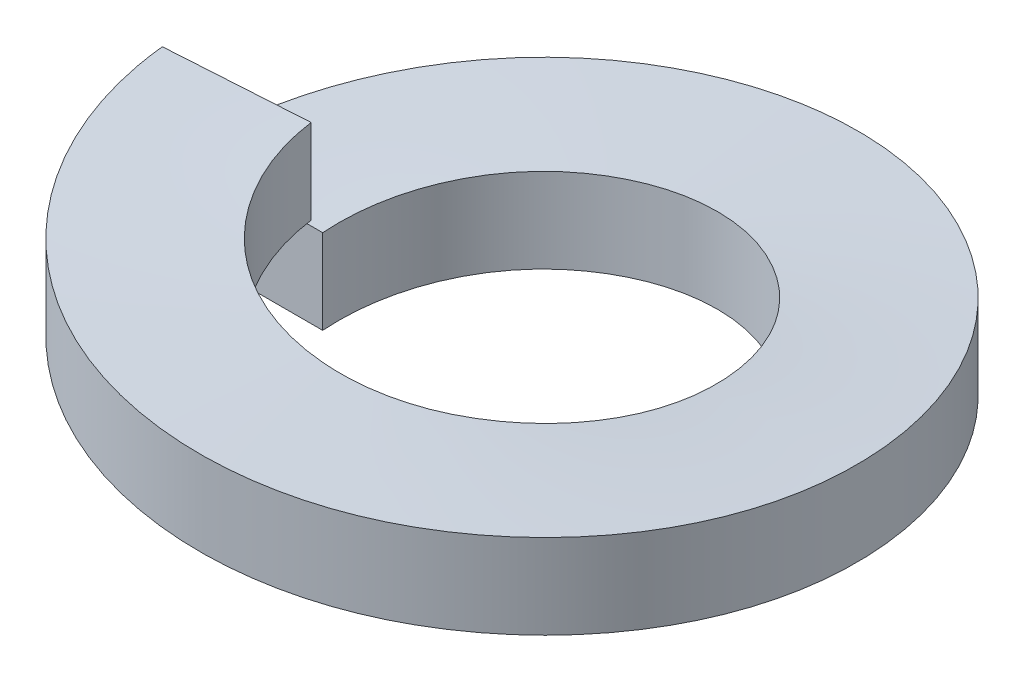
ISO-10303-21;
HEADER;
FILE_DESCRIPTION(('STEP AP214'),'2;1');
FILE_NAME('part.step','',(''),(''),'','','');
FILE_SCHEMA(('AUTOMOTIVE_DESIGN { 1 0 10303 214 1 1 1 1 }'));
ENDSEC;
DATA;
#1=APPLICATION_CONTEXT('core data for automotive mechanical design processes');
#2=APPLICATION_PROTOCOL_DEFINITION('international standard','automotive_design',2000,#1);
#3=PRODUCT_CONTEXT('',#1,'mechanical');
#4=PRODUCT('Part','Part','',(#3));
#5=PRODUCT_RELATED_PRODUCT_CATEGORY('part','',(#4));
#6=PRODUCT_DEFINITION_FORMATION('','',#4);
#7=PRODUCT_DEFINITION_CONTEXT('part definition',#1,'design');
#8=PRODUCT_DEFINITION('design','',#6,#7);
#9=PRODUCT_DEFINITION_SHAPE('','',#8);
#10=(LENGTH_UNIT() NAMED_UNIT(*) SI_UNIT(.MILLI.,.METRE.));
#11=(NAMED_UNIT(*) PLANE_ANGLE_UNIT() SI_UNIT($,.RADIAN.));
#12=(NAMED_UNIT(*) SI_UNIT($,.STERADIAN.) SOLID_ANGLE_UNIT());
#13=UNCERTAINTY_MEASURE_WITH_UNIT(LENGTH_MEASURE(1.E-05),#10,'distance_accuracy_value','');
#14=(GEOMETRIC_REPRESENTATION_CONTEXT(3) GLOBAL_UNCERTAINTY_ASSIGNED_CONTEXT((#13)) GLOBAL_UNIT_ASSIGNED_CONTEXT((#10,
#11,#12)) REPRESENTATION_CONTEXT('',''));
#15=CARTESIAN_POINT('',(0.,0.,0.));
#16=DIRECTION('',(0.,0.,1.));
#17=DIRECTION('',(1.,0.,0.));
#18=AXIS2_PLACEMENT_3D('',#15,#16,#17);
#19=CARTESIAN_POINT('',(0.,0.,0.));
#20=DIRECTION('',(0.,1.,0.));
#21=DIRECTION('',(1.,0.,0.));
#22=AXIS2_PLACEMENT_3D('',#19,#20,#21);
#23=CYLINDRICAL_SURFACE('',#22,4.25);
#24=CARTESIAN_POINT('',(-4.25,0.,0.));
#25=CARTESIAN_POINT('',(-4.25,0.19,-2.42415720111151));
#26=CARTESIAN_POINT('',(-2.16342601693907,0.38,-3.65815361476677));
#27=CARTESIAN_POINT('',(-1.1626684330995,0.471127341984099,-4.25));
#28=CARTESIAN_POINT('',(0.,0.576023489908225,-4.25));
#29=(BOUNDED_CURVE() B_SPLINE_CURVE(2,(#24,#25,#26,#27,#28),.UNSPECIFIED.,.F.,
.F.) B_SPLINE_CURVE_WITH_KNOTS((3,2,3),(0.,0.166666666666667,0.252468503816904),
.UNSPECIFIED.) CURVE() GEOMETRIC_REPRESENTATION_ITEM() RATIONAL_B_SPLINE_CURVE((1.,
0.868631514438191,1.,0.932370055570913,0.934373392882436)) REPRESENTATION_ITEM(''));
#30=CARTESIAN_POINT('',(-4.25,0.,0.));
#31=VERTEX_POINT('',#30);
#32=CARTESIAN_POINT('',(0.,0.576023489908225,-4.25));
#33=VERTEX_POINT('',#32);
#34=EDGE_CURVE('E10',#31,#33,#29,.T.);
#35=ORIENTED_EDGE('',*,*,#34,.T.);
#36=CARTESIAN_POINT('',(0.,0.576023489908225,-4.25));
#37=CARTESIAN_POINT('',(1.09121453156285,0.674473054428204,-4.25));
#38=CARTESIAN_POINT('',(2.04745311493231,0.76,-3.72430339018641));
#39=CARTESIAN_POINT('',(4.17175826374275,0.95,-2.5564567519508));
#40=CARTESIAN_POINT('',(4.24790288155436,1.14,-0.133495726082015));
#41=CARTESIAN_POINT('',(4.32404749936597,1.33,2.28946529978677));
#42=CARTESIAN_POINT('',(2.2772638786607,1.52,3.58839368338359));
#43=CARTESIAN_POINT('',(1.23473914111062,1.61677608230335,4.25));
#44=CARTESIAN_POINT('',(0.,1.72806452526736,4.25));
#45=(BOUNDED_CURVE() B_SPLINE_CURVE(2,(#36,#37,#38,#39,#40,#41,#42,#43,#44),.UNSPECIFIED.,.F.,
.F.) B_SPLINE_CURVE_WITH_KNOTS((3,2,2,2,3),(0.252468503816904,0.333333333333333,0.5,
0.666666666666667,0.757406729884102),
.UNSPECIFIED.) CURVE() GEOMETRIC_REPRESENTATION_ITEM() RATIONAL_B_SPLINE_CURVE((0.934373392882436,
0.936261458867277,1.,0.868631514438191,1.,0.868631514438191,1.,0.928477691892056,0.934834648894173)) REPRESENTATION_ITEM(''));
#46=CARTESIAN_POINT('',(0.,1.72806452526736,4.25));
#47=VERTEX_POINT('',#46);
#48=EDGE_CURVE('E26',#33,#47,#45,.T.);
#49=ORIENTED_EDGE('',*,*,#48,.T.);
#50=CARTESIAN_POINT('',(0.,1.72806452526736,4.25));
#51=CARTESIAN_POINT('',(-1.02033472609052,1.82002845447964,4.25));
#52=CARTESIAN_POINT('',(-1.92945962389312,1.9,3.78677772780054));
#53=CARTESIAN_POINT('',(-4.08939950574167,2.09,2.68623338862068));
#54=CARTESIAN_POINT('',(-4.24161359582016,2.28,0.266859707999521));
#55=(BOUNDED_CURVE() B_SPLINE_CURVE(2,(#50,#51,#52,#53,#54),.UNSPECIFIED.,.F.,
.F.) B_SPLINE_CURVE_WITH_KNOTS((3,2,3),(0.757406729884102,0.833333333333333,1.),
.UNSPECIFIED.) CURVE() GEOMETRIC_REPRESENTATION_ITEM() RATIONAL_B_SPLINE_CURVE((0.934834648894173,
0.940153822546135,1.,0.868631514438191,1.)) REPRESENTATION_ITEM(''));
#56=CARTESIAN_POINT('',(-4.24161359582016,2.28,0.266859707999521));
#57=VERTEX_POINT('',#56);
#58=EDGE_CURVE('E175',#47,#57,#55,.T.);
#59=ORIENTED_EDGE('',*,*,#58,.T.);
#60=DIRECTION('',(0.,1.,0.));
#61=VECTOR('',#60,1.);
#62=CARTESIAN_POINT('',(-4.24161359582016,2.28,0.266859707999521));
#63=LINE('',#62,#61);
#64=CARTESIAN_POINT('',(-4.24161359582016,4.18,0.266859707999521));
#65=VERTEX_POINT('',#64);
#66=EDGE_CURVE('E97',#57,#65,#63,.T.);
#67=ORIENTED_EDGE('',*,*,#66,.T.);
#68=CARTESIAN_POINT('',(0.,3.62806452526736,4.25));
#69=CARTESIAN_POINT('',(-1.02033472609052,3.72002845447964,4.25));
#70=CARTESIAN_POINT('',(-1.92945962389312,3.8,3.78677772780054));
#71=CARTESIAN_POINT('',(-4.08939950574167,3.99,2.68623338862068));
#72=CARTESIAN_POINT('',(-4.24161359582016,4.18,0.266859707999521));
#73=(BOUNDED_CURVE() B_SPLINE_CURVE(2,(#68,#69,#70,#71,#72),.UNSPECIFIED.,.F.,
.F.) B_SPLINE_CURVE_WITH_KNOTS((3,2,3),(0.757406729884102,0.833333333333333,1.),
.UNSPECIFIED.) CURVE() GEOMETRIC_REPRESENTATION_ITEM() RATIONAL_B_SPLINE_CURVE((0.934834648894173,
0.940153822546135,1.,0.868631514438191,1.)) REPRESENTATION_ITEM(''));
#74=CARTESIAN_POINT('',(0.,3.62806452526736,4.25));
#75=VERTEX_POINT('',#74);
#76=EDGE_CURVE('E164',#75,#65,#73,.T.);
#77=ORIENTED_EDGE('',*,*,#76,.F.);
#78=CARTESIAN_POINT('',(0.,2.47602348990823,-4.25));
#79=CARTESIAN_POINT('',(1.09121453156285,2.5744730544282,-4.25));
#80=CARTESIAN_POINT('',(2.04745311493231,2.66,-3.72430339018641));
#81=CARTESIAN_POINT('',(4.17175826374275,2.85,-2.5564567519508));
#82=CARTESIAN_POINT('',(4.24790288155436,3.04,-0.133495726082015));
#83=CARTESIAN_POINT('',(4.32404749936597,3.23,2.28946529978677));
#84=CARTESIAN_POINT('',(2.2772638786607,3.42,3.58839368338359));
#85=CARTESIAN_POINT('',(1.23473914111062,3.51677608230335,4.25));
#86=CARTESIAN_POINT('',(0.,3.62806452526736,4.25));
#87=(BOUNDED_CURVE() B_SPLINE_CURVE(2,(#78,#79,#80,#81,#82,#83,#84,#85,#86),.UNSPECIFIED.,.F.,
.F.) B_SPLINE_CURVE_WITH_KNOTS((3,2,2,2,3),(0.252468503816904,0.333333333333333,0.5,
0.666666666666667,0.757406729884102),
.UNSPECIFIED.) CURVE() GEOMETRIC_REPRESENTATION_ITEM() RATIONAL_B_SPLINE_CURVE((0.934373392882436,
0.936261458867277,1.,0.868631514438191,1.,0.868631514438191,1.,0.928477691892056,0.934834648894173)) REPRESENTATION_ITEM(''));
#88=CARTESIAN_POINT('',(0.,2.47602348990823,-4.25));
#89=VERTEX_POINT('',#88);
#90=EDGE_CURVE('E103',#89,#75,#87,.T.);
#91=ORIENTED_EDGE('',*,*,#90,.F.);
#92=CARTESIAN_POINT('',(-4.25,1.9,0.));
#93=CARTESIAN_POINT('',(-4.25,2.09,-2.42415720111151));
#94=CARTESIAN_POINT('',(-2.16342601693907,2.28,-3.65815361476677));
#95=CARTESIAN_POINT('',(-1.1626684330995,2.3711273419841,-4.25));
#96=CARTESIAN_POINT('',(0.,2.47602348990823,-4.25));
#97=(BOUNDED_CURVE() B_SPLINE_CURVE(2,(#92,#93,#94,#95,#96),.UNSPECIFIED.,.F.,
.F.) B_SPLINE_CURVE_WITH_KNOTS((3,2,3),(0.,0.166666666666667,0.252468503816904),
.UNSPECIFIED.) CURVE() GEOMETRIC_REPRESENTATION_ITEM() RATIONAL_B_SPLINE_CURVE((1.,
0.868631514438191,1.,0.932370055570913,0.934373392882436)) REPRESENTATION_ITEM(''));
#98=CARTESIAN_POINT('',(-4.25,1.9,0.));
#99=VERTEX_POINT('',#98);
#100=EDGE_CURVE('E100',#99,#89,#97,.T.);
#101=ORIENTED_EDGE('',*,*,#100,.F.);
#102=DIRECTION('',(0.,1.,0.));
#103=VECTOR('',#102,1.);
#104=CARTESIAN_POINT('',(-4.25,0.,0.));
#105=LINE('',#104,#103);
#106=EDGE_CURVE('E109',#31,#99,#105,.T.);
#107=ORIENTED_EDGE('',*,*,#106,.F.);
#108=EDGE_LOOP('',(#35,#49,#59,#67,#77,#91,#101,#107));
#109=FACE_BOUND('',#108,.T.);
#110=ADVANCED_FACE('F16',(#109),#23,.F.);
#111=CARTESIAN_POINT('',(0.,0.,0.));
#112=DIRECTION('',(0.,1.,0.));
#113=DIRECTION('',(1.,0.,0.));
#114=AXIS2_PLACEMENT_3D('',#111,#112,#113);
#115=CYLINDRICAL_SURFACE('',#114,7.4);
#116=CARTESIAN_POINT('',(0.,0.576023489908225,-7.4));
#117=CARTESIAN_POINT('',(1.8999970667212,0.674473054428204,-7.4));
#118=CARTESIAN_POINT('',(3.56497718835272,0.76,-6.48466943232457));
#119=CARTESIAN_POINT('',(7.26376732981091,0.95,-4.45124234457316));
#120=CARTESIAN_POINT('',(7.39634854670642,1.14,-0.232439617178096));
#121=CARTESIAN_POINT('',(7.52892976360192,1.33,3.98636311021696));
#122=CARTESIAN_POINT('',(3.96511828284452,1.52,6.24802664871495));
#123=CARTESIAN_POINT('',(2.14989873981614,1.61677608230335,7.4));
#124=CARTESIAN_POINT('',(0.,1.72806452526736,7.4));
#125=(BOUNDED_CURVE() B_SPLINE_CURVE(2,(#116,#117,#118,#119,#120,#121,#122,#123,#124),
.UNSPECIFIED.,.F.,.F.) B_SPLINE_CURVE_WITH_KNOTS((3,2,2,2,3),(0.252468503816904,
0.333333333333333,0.5,0.666666666666667,0.757406729884102),
.UNSPECIFIED.) CURVE() GEOMETRIC_REPRESENTATION_ITEM() RATIONAL_B_SPLINE_CURVE((0.934373392882436,
0.936261458867277,1.,0.868631514438191,1.,0.868631514438191,1.,0.928477691892056,0.934834648894173)) REPRESENTATION_ITEM(''));
#126=CARTESIAN_POINT('',(0.,0.576023489908225,-7.4));
#127=VERTEX_POINT('',#126);
#128=CARTESIAN_POINT('',(0.,1.72806452526736,7.4));
#129=VERTEX_POINT('',#128);
#130=EDGE_CURVE('E87',#127,#129,#125,.T.);
#131=ORIENTED_EDGE('',*,*,#130,.F.);
#132=CARTESIAN_POINT('',(-7.4,0.,0.));
#133=CARTESIAN_POINT('',(-7.4,0.19,-4.22088547958239));
#134=CARTESIAN_POINT('',(-3.76690647655273,0.38,-6.36949099982919));
#135=CARTESIAN_POINT('',(-2.02441091880855,0.471127341984099,-7.4));
#136=CARTESIAN_POINT('',(0.,0.576023489908225,-7.4));
#137=(BOUNDED_CURVE() B_SPLINE_CURVE(2,(#132,#133,#134,#135,#136),.UNSPECIFIED.,.F.,
.F.) B_SPLINE_CURVE_WITH_KNOTS((3,2,3),(0.,0.166666666666667,0.252468503816904),
.UNSPECIFIED.) CURVE() GEOMETRIC_REPRESENTATION_ITEM() RATIONAL_B_SPLINE_CURVE((1.,
0.868631514438191,1.,0.932370055570913,0.934373392882436)) REPRESENTATION_ITEM(''));
#138=CARTESIAN_POINT('',(-7.4,0.,0.));
#139=VERTEX_POINT('',#138);
#140=EDGE_CURVE('E110',#139,#127,#137,.T.);
#141=ORIENTED_EDGE('',*,*,#140,.F.);
#142=DIRECTION('',(0.,-1.,0.));
#143=VECTOR('',#142,1.);
#144=CARTESIAN_POINT('',(-7.4,1.9,0.));
#145=LINE('',#144,#143);
#146=CARTESIAN_POINT('',(-7.4,1.9,0.));
#147=VERTEX_POINT('',#146);
#148=EDGE_CURVE('E93',#147,#139,#145,.T.);
#149=ORIENTED_EDGE('',*,*,#148,.F.);
#150=CARTESIAN_POINT('',(-7.4,1.9,0.));
#151=CARTESIAN_POINT('',(-7.4,2.09,-4.22088547958239));
#152=CARTESIAN_POINT('',(-3.76690647655273,2.28,-6.36949099982919));
#153=CARTESIAN_POINT('',(-2.02441091880855,2.3711273419841,-7.4));
#154=CARTESIAN_POINT('',(0.,2.47602348990823,-7.4));
#155=(BOUNDED_CURVE() B_SPLINE_CURVE(2,(#150,#151,#152,#153,#154),.UNSPECIFIED.,.F.,
.F.) B_SPLINE_CURVE_WITH_KNOTS((3,2,3),(0.,0.166666666666667,0.252468503816904),
.UNSPECIFIED.) CURVE() GEOMETRIC_REPRESENTATION_ITEM() RATIONAL_B_SPLINE_CURVE((1.,
0.868631514438191,1.,0.932370055570913,0.934373392882436)) REPRESENTATION_ITEM(''));
#156=CARTESIAN_POINT('',(0.,2.47602348990823,-7.4));
#157=VERTEX_POINT('',#156);
#158=EDGE_CURVE('E129',#147,#157,#155,.T.);
#159=ORIENTED_EDGE('',*,*,#158,.T.);
#160=CARTESIAN_POINT('',(0.,2.47602348990823,-7.4));
#161=CARTESIAN_POINT('',(1.8999970667212,2.5744730544282,-7.4));
#162=CARTESIAN_POINT('',(3.56497718835272,2.66,-6.48466943232457));
#163=CARTESIAN_POINT('',(7.26376732981091,2.85,-4.45124234457316));
#164=CARTESIAN_POINT('',(7.39634854670642,3.04,-0.232439617178096));
#165=CARTESIAN_POINT('',(7.52892976360192,3.23,3.98636311021696));
#166=CARTESIAN_POINT('',(3.96511828284452,3.42,6.24802664871495));
#167=CARTESIAN_POINT('',(2.14989873981614,3.51677608230335,7.4));
#168=CARTESIAN_POINT('',(0.,3.62806452526736,7.4));
#169=(BOUNDED_CURVE() B_SPLINE_CURVE(2,(#160,#161,#162,#163,#164,#165,#166,#167,#168),
.UNSPECIFIED.,.F.,.F.) B_SPLINE_CURVE_WITH_KNOTS((3,2,2,2,3),(0.252468503816904,
0.333333333333333,0.5,0.666666666666667,0.757406729884102),
.UNSPECIFIED.) CURVE() GEOMETRIC_REPRESENTATION_ITEM() RATIONAL_B_SPLINE_CURVE((0.934373392882436,
0.936261458867277,1.,0.868631514438191,1.,0.868631514438191,1.,0.928477691892056,0.934834648894173)) REPRESENTATION_ITEM(''));
#170=CARTESIAN_POINT('',(0.,3.62806452526736,7.4));
#171=VERTEX_POINT('',#170);
#172=EDGE_CURVE('E122',#157,#171,#169,.T.);
#173=ORIENTED_EDGE('',*,*,#172,.T.);
#174=CARTESIAN_POINT('',(0.,3.62806452526736,7.4));
#175=CARTESIAN_POINT('',(-1.77658281719291,3.72002845447964,7.4));
#176=CARTESIAN_POINT('',(-3.35952969807272,3.8,6.59344827899388));
#177=CARTESIAN_POINT('',(-7.12036619823256,3.99,4.67720637077483));
#178=CARTESIAN_POINT('',(-7.38539779036922,4.18,0.464649844516813));
#179=(BOUNDED_CURVE() B_SPLINE_CURVE(2,(#174,#175,#176,#177,#178),.UNSPECIFIED.,.F.,
.F.) B_SPLINE_CURVE_WITH_KNOTS((3,2,3),(0.757406729884102,0.833333333333333,1.),
.UNSPECIFIED.) CURVE() GEOMETRIC_REPRESENTATION_ITEM() RATIONAL_B_SPLINE_CURVE((0.934834648894173,
0.940153822546135,1.,0.868631514438191,1.)) REPRESENTATION_ITEM(''));
#180=CARTESIAN_POINT('',(-7.38539779036922,4.18,0.464649844516813));
#181=VERTEX_POINT('',#180);
#182=EDGE_CURVE('E91',#171,#181,#179,.T.);
#183=ORIENTED_EDGE('',*,*,#182,.T.);
#184=DIRECTION('',(0.,-1.,0.));
#185=VECTOR('',#184,1.);
#186=CARTESIAN_POINT('',(-7.38539779036922,4.18,0.464649844516813));
#187=LINE('',#186,#185);
#188=CARTESIAN_POINT('',(-7.38539779036922,2.28,0.464649844516813));
#189=VERTEX_POINT('',#188);
#190=EDGE_CURVE('E77',#181,#189,#187,.T.);
#191=ORIENTED_EDGE('',*,*,#190,.T.);
#192=CARTESIAN_POINT('',(0.,1.72806452526736,7.4));
#193=CARTESIAN_POINT('',(-1.77658281719291,1.82002845447964,7.4));
#194=CARTESIAN_POINT('',(-3.35952969807272,1.9,6.59344827899388));
#195=CARTESIAN_POINT('',(-7.12036619823256,2.09,4.67720637077483));
#196=CARTESIAN_POINT('',(-7.38539779036922,2.28,0.464649844516813));
#197=(BOUNDED_CURVE() B_SPLINE_CURVE(2,(#192,#193,#194,#195,#196),.UNSPECIFIED.,.F.,
.F.) B_SPLINE_CURVE_WITH_KNOTS((3,2,3),(0.757406729884102,0.833333333333333,1.),
.UNSPECIFIED.) CURVE() GEOMETRIC_REPRESENTATION_ITEM() RATIONAL_B_SPLINE_CURVE((0.934834648894173,
0.940153822546135,1.,0.868631514438191,1.)) REPRESENTATION_ITEM(''));
#198=EDGE_CURVE('E83',#129,#189,#197,.T.);
#199=ORIENTED_EDGE('',*,*,#198,.F.);
#200=EDGE_LOOP('',(#131,#141,#149,#159,#173,#183,#191,#199));
#201=FACE_BOUND('',#200,.T.);
#202=ADVANCED_FACE('F18',(#201),#115,.T.);
#203=CARTESIAN_POINT('',(-7.4,0.,0.));
#204=DIRECTION('',(0.,0.,1.));
#205=DIRECTION('',(1.,0.,0.));
#206=AXIS2_PLACEMENT_3D('',#203,#204,#205);
#207=PLANE('',#206);
#208=ORIENTED_EDGE('',*,*,#148,.T.);
#209=DIRECTION('',(1.,0.,0.));
#210=VECTOR('',#209,1.);
#211=CARTESIAN_POINT('',(-7.4,0.,0.));
#212=LINE('',#211,#210);
#213=EDGE_CURVE('E111',#139,#31,#212,.T.);
#214=ORIENTED_EDGE('',*,*,#213,.T.);
#215=ORIENTED_EDGE('',*,*,#106,.T.);
#216=DIRECTION('',(-1.,0.,0.));
#217=VECTOR('',#216,1.);
#218=CARTESIAN_POINT('',(-4.25,1.9,0.));
#219=LINE('',#218,#217);
#220=EDGE_CURVE('E106',#99,#147,#219,.T.);
#221=ORIENTED_EDGE('',*,*,#220,.T.);
#222=EDGE_LOOP('',(#208,#214,#215,#221));
#223=FACE_BOUND('',#222,.T.);
#224=ADVANCED_FACE('F194',(#223),#207,.T.);
#225=CARTESIAN_POINT('',(-7.38539779036922,2.28,0.464649844516813));
#226=DIRECTION('',(0.0627905195292991,0.,0.998026728428272));
#227=DIRECTION('',(0.998026728428272,0.,-0.0627905195292991));
#228=AXIS2_PLACEMENT_3D('',#225,#226,#227);
#229=PLANE('',#228);
#230=ORIENTED_EDGE('',*,*,#190,.F.);
#231=DIRECTION('',(-0.998026728428273,0.,0.0627905195292991));
#232=VECTOR('',#231,1.);
#233=CARTESIAN_POINT('',(-4.24161359582016,4.18,0.266859707999521));
#234=LINE('',#233,#232);
#235=EDGE_CURVE('E99',#65,#181,#234,.T.);
#236=ORIENTED_EDGE('',*,*,#235,.F.);
#237=ORIENTED_EDGE('',*,*,#66,.F.);
#238=DIRECTION('',(0.998026728428273,0.,-0.0627905195292991));
#239=VECTOR('',#238,1.);
#240=CARTESIAN_POINT('',(-7.38539779036922,2.28,0.464649844516813));
#241=LINE('',#240,#239);
#242=EDGE_CURVE('E20',#189,#57,#241,.T.);
#243=ORIENTED_EDGE('',*,*,#242,.F.);
#244=EDGE_LOOP('',(#230,#236,#237,#243));
#245=FACE_BOUND('',#244,.T.);
#246=ADVANCED_FACE('F95',(#245),#229,.F.);
#247=CARTESIAN_POINT('',(-7.4,0.,0.));
#248=CARTESIAN_POINT('',(-7.4,0.19,-4.22088547958239));
#249=CARTESIAN_POINT('',(-3.76690647655273,0.38,-6.36949099982919));
#250=CARTESIAN_POINT('',(-0.133812953105465,0.57,-8.51809652007599));
#251=CARTESIAN_POINT('',(3.56497718835272,0.76,-6.48466943232457));
#252=CARTESIAN_POINT('',(7.26376732981091,0.95,-4.45124234457316));
#253=CARTESIAN_POINT('',(7.39634854670642,1.14,-0.232439617178096));
#254=CARTESIAN_POINT('',(7.52892976360192,1.33,3.98636311021696));
#255=CARTESIAN_POINT('',(3.96511828284452,1.52,6.24802664871495));
#256=CARTESIAN_POINT('',(0.401306802087113,1.71,8.50969018721293));
#257=CARTESIAN_POINT('',(-3.35952969807272,1.9,6.59344827899388));
#258=CARTESIAN_POINT('',(-7.12036619823256,2.09,4.67720637077483));
#259=CARTESIAN_POINT('',(-7.38539779036922,2.28,0.464649844516813));
#260=CARTESIAN_POINT('',(-4.25,0.,0.));
#261=CARTESIAN_POINT('',(-4.25,0.19,-2.42415720111151));
#262=CARTESIAN_POINT('',(-2.16342601693907,0.38,-3.65815361476677));
#263=CARTESIAN_POINT('',(-0.0768520338781386,0.57,-4.89215002842202));
#264=CARTESIAN_POINT('',(2.04745311493231,0.76,-3.72430339018641));
#265=CARTESIAN_POINT('',(4.17175826374275,0.95,-2.5564567519508));
#266=CARTESIAN_POINT('',(4.24790288155436,1.14,-0.133495726082015));
#267=CARTESIAN_POINT('',(4.32404749936597,1.33,2.28946529978677));
#268=CARTESIAN_POINT('',(2.2772638786607,1.52,3.58839368338359));
#269=CARTESIAN_POINT('',(0.230480257955437,1.71,4.8873220669804));
#270=CARTESIAN_POINT('',(-1.92945962389312,1.9,3.78677772780054));
#271=CARTESIAN_POINT('',(-4.08939950574167,2.09,2.68623338862068));
#272=CARTESIAN_POINT('',(-4.24161359582016,2.28,0.266859707999521));
#273=(BOUNDED_SURFACE() B_SPLINE_SURFACE(1,2,((#247,#248,#249,#250,#251,#252,#253,#254,#255,
#256,#257,#258,#259),(#260,#261,#262,#263,#264,#265,#266,#267,#268,#269,#270,#271,#272)),
.UNSPECIFIED.,.F.,.F.,.F.) B_SPLINE_SURFACE_WITH_KNOTS((2,2),(3,2,2,2,2,2,3),(0.,1.),(0.,
0.166666666666667,0.333333333333333,0.5,0.666666666666667,0.833333333333333,1.),
.UNSPECIFIED.) GEOMETRIC_REPRESENTATION_ITEM() RATIONAL_B_SPLINE_SURFACE(((1.,0.868631514438191,
1.,0.868631514438191,1.,0.868631514438191,1.,0.868631514438191,1.,0.868631514438191,1.,
0.868631514438191,1.),(1.,0.868631514438191,1.,0.868631514438191,1.,0.868631514438191,1.,
0.868631514438191,1.,0.868631514438191,1.,0.868631514438191,1.))) REPRESENTATION_ITEM('') SURFACE());
#274=ORIENTED_EDGE('',*,*,#34,.F.);
#275=ORIENTED_EDGE('',*,*,#213,.F.);
#276=ORIENTED_EDGE('',*,*,#140,.T.);
#277=ORIENTED_EDGE('',*,*,#130,.T.);
#278=ORIENTED_EDGE('',*,*,#198,.T.);
#279=ORIENTED_EDGE('',*,*,#242,.T.);
#280=ORIENTED_EDGE('',*,*,#58,.F.);
#281=ORIENTED_EDGE('',*,*,#48,.F.);
#282=EDGE_LOOP('',(#274,#275,#276,#277,#278,#279,#280,#281));
#283=FACE_BOUND('',#282,.T.);
#284=ADVANCED_FACE('F84',(#283),#273,.F.);
#285=CARTESIAN_POINT('',(-4.25,1.9,0.));
#286=CARTESIAN_POINT('',(-4.25,2.09,-2.42415720111151));
#287=CARTESIAN_POINT('',(-2.16342601693907,2.28,-3.65815361476677));
#288=CARTESIAN_POINT('',(-0.0768520338781386,2.47,-4.89215002842202));
#289=CARTESIAN_POINT('',(2.04745311493231,2.66,-3.72430339018641));
#290=CARTESIAN_POINT('',(4.17175826374275,2.85,-2.5564567519508));
#291=CARTESIAN_POINT('',(4.24790288155436,3.04,-0.133495726082015));
#292=CARTESIAN_POINT('',(4.32404749936597,3.23,2.28946529978677));
#293=CARTESIAN_POINT('',(2.2772638786607,3.42,3.58839368338359));
#294=CARTESIAN_POINT('',(0.230480257955437,3.61,4.8873220669804));
#295=CARTESIAN_POINT('',(-1.92945962389312,3.8,3.78677772780054));
#296=CARTESIAN_POINT('',(-4.08939950574167,3.99,2.68623338862068));
#297=CARTESIAN_POINT('',(-4.24161359582016,4.18,0.266859707999521));
#298=CARTESIAN_POINT('',(-7.4,1.9,0.));
#299=CARTESIAN_POINT('',(-7.4,2.09,-4.22088547958239));
#300=CARTESIAN_POINT('',(-3.76690647655273,2.28,-6.36949099982919));
#301=CARTESIAN_POINT('',(-0.133812953105465,2.47,-8.51809652007599));
#302=CARTESIAN_POINT('',(3.56497718835272,2.66,-6.48466943232457));
#303=CARTESIAN_POINT('',(7.26376732981091,2.85,-4.45124234457316));
#304=CARTESIAN_POINT('',(7.39634854670642,3.04,-0.232439617178096));
#305=CARTESIAN_POINT('',(7.52892976360192,3.23,3.98636311021696));
#306=CARTESIAN_POINT('',(3.96511828284452,3.42,6.24802664871495));
#307=CARTESIAN_POINT('',(0.401306802087113,3.61,8.50969018721293));
#308=CARTESIAN_POINT('',(-3.35952969807272,3.8,6.59344827899388));
#309=CARTESIAN_POINT('',(-7.12036619823256,3.99,4.67720637077483));
#310=CARTESIAN_POINT('',(-7.38539779036922,4.18,0.464649844516813));
#311=(BOUNDED_SURFACE() B_SPLINE_SURFACE(1,2,((#285,#286,#287,#288,#289,#290,#291,#292,#293,
#294,#295,#296,#297),(#298,#299,#300,#301,#302,#303,#304,#305,#306,#307,#308,#309,#310)),
.UNSPECIFIED.,.F.,.F.,.F.) B_SPLINE_SURFACE_WITH_KNOTS((2,2),(3,2,2,2,2,2,3),(0.,1.),(0.,
0.166666666666667,0.333333333333333,0.5,0.666666666666667,0.833333333333333,1.),
.UNSPECIFIED.) GEOMETRIC_REPRESENTATION_ITEM() RATIONAL_B_SPLINE_SURFACE(((1.,0.868631514438191,
1.,0.868631514438191,1.,0.868631514438191,1.,0.868631514438191,1.,0.868631514438191,1.,
0.868631514438191,1.),(1.,0.868631514438191,1.,0.868631514438191,1.,0.868631514438191,1.,
0.868631514438191,1.,0.868631514438191,1.,0.868631514438191,1.))) REPRESENTATION_ITEM('') SURFACE());
#312=ORIENTED_EDGE('',*,*,#235,.T.);
#313=ORIENTED_EDGE('',*,*,#182,.F.);
#314=ORIENTED_EDGE('',*,*,#172,.F.);
#315=ORIENTED_EDGE('',*,*,#158,.F.);
#316=ORIENTED_EDGE('',*,*,#220,.F.);
#317=ORIENTED_EDGE('',*,*,#100,.T.);
#318=ORIENTED_EDGE('',*,*,#90,.T.);
#319=ORIENTED_EDGE('',*,*,#76,.T.);
#320=EDGE_LOOP('',(#312,#313,#314,#315,#316,#317,#318,#319));
#321=FACE_BOUND('',#320,.T.);
#322=ADVANCED_FACE('F198',(#321),#311,.F.);
#323=CLOSED_SHELL('',(#110,#202,#224,#246,#284,#322));
#324=MANIFOLD_SOLID_BREP('B1',#323);
#325=ADVANCED_BREP_SHAPE_REPRESENTATION('',(#18,#324),#14);
#326=SHAPE_DEFINITION_REPRESENTATION(#9,#325);
ENDSEC;
END-ISO-10303-21;
